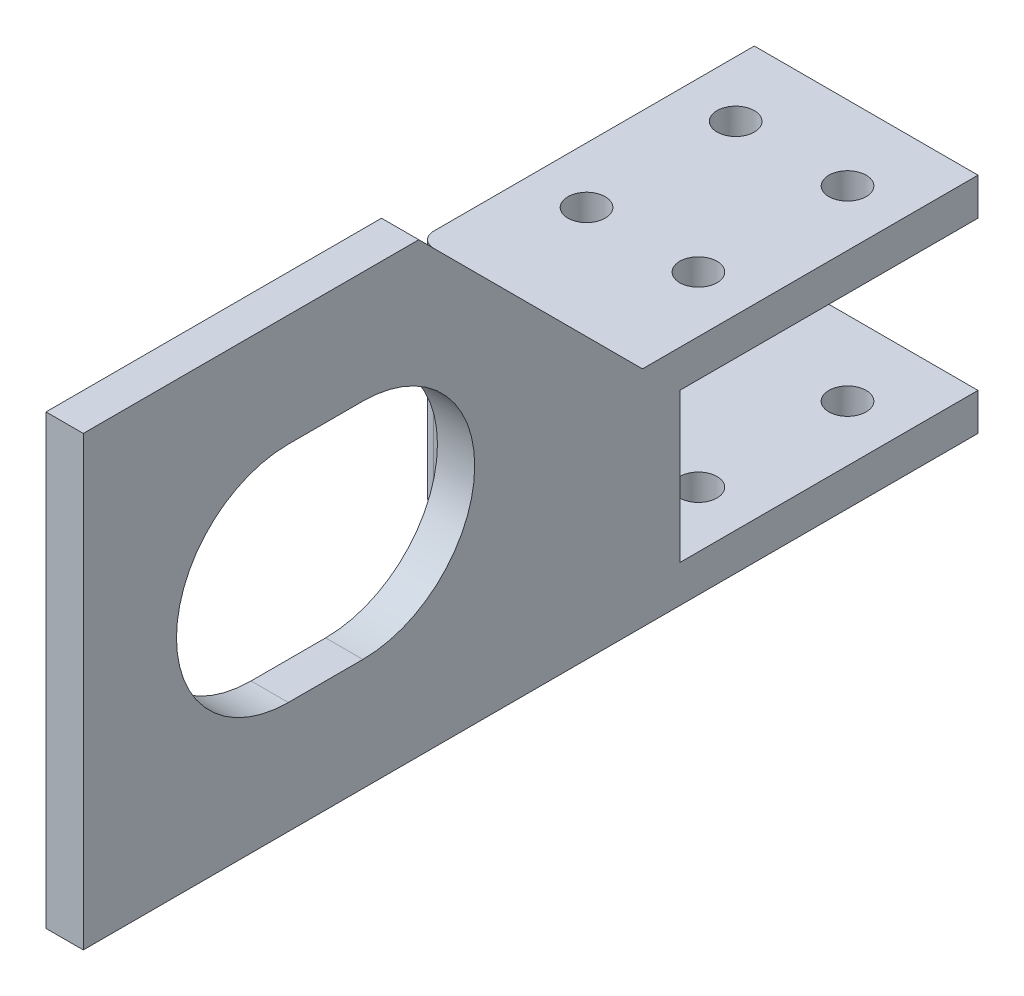
ISO-10303-21;
HEADER;
FILE_DESCRIPTION(('STEP AP214'),'2;1');
FILE_NAME('part.step','',(''),(''),'','','');
FILE_SCHEMA(('AUTOMOTIVE_DESIGN { 1 0 10303 214 1 1 1 1 }'));
ENDSEC;
DATA;
#1=APPLICATION_CONTEXT('core data for automotive mechanical design processes');
#2=APPLICATION_PROTOCOL_DEFINITION('international standard','automotive_design',2000,#1);
#3=PRODUCT_CONTEXT('',#1,'mechanical');
#4=PRODUCT('Part','Part','',(#3));
#5=PRODUCT_RELATED_PRODUCT_CATEGORY('part','',(#4));
#6=PRODUCT_DEFINITION_FORMATION('','',#4);
#7=PRODUCT_DEFINITION_CONTEXT('part definition',#1,'design');
#8=PRODUCT_DEFINITION('design','',#6,#7);
#9=PRODUCT_DEFINITION_SHAPE('','',#8);
#10=(LENGTH_UNIT() NAMED_UNIT(*) SI_UNIT(.MILLI.,.METRE.));
#11=(NAMED_UNIT(*) PLANE_ANGLE_UNIT() SI_UNIT($,.RADIAN.));
#12=(NAMED_UNIT(*) SI_UNIT($,.STERADIAN.) SOLID_ANGLE_UNIT());
#13=UNCERTAINTY_MEASURE_WITH_UNIT(LENGTH_MEASURE(1.E-05),#10,'distance_accuracy_value','');
#14=(GEOMETRIC_REPRESENTATION_CONTEXT(3) GLOBAL_UNCERTAINTY_ASSIGNED_CONTEXT((#13)) GLOBAL_UNIT_ASSIGNED_CONTEXT((#10,
#11,#12)) REPRESENTATION_CONTEXT('',''));
#15=CARTESIAN_POINT('',(0.,0.,0.));
#16=DIRECTION('',(0.,0.,1.));
#17=DIRECTION('',(1.,0.,0.));
#18=AXIS2_PLACEMENT_3D('',#15,#16,#17);
#19=CARTESIAN_POINT('',(15.,-15.,25.));
#20=DIRECTION('',(0.,0.,-1.));
#21=DIRECTION('',(-1.,0.,0.));
#22=AXIS2_PLACEMENT_3D('',#19,#20,#21);
#23=PLANE('',#22);
#24=DIRECTION('',(-1.,0.,0.));
#25=VECTOR('',#24,1.);
#26=CARTESIAN_POINT('',(15.,15.,25.));
#27=LINE('',#26,#25);
#28=CARTESIAN_POINT('',(5.,15.,25.));
#29=VERTEX_POINT('',#28);
#30=CARTESIAN_POINT('',(-13.,15.,25.));
#31=VERTEX_POINT('',#30);
#32=EDGE_CURVE('E310',#29,#31,#27,.T.);
#33=ORIENTED_EDGE('',*,*,#32,.T.);
#34=DIRECTION('',(0.,1.,0.));
#35=VECTOR('',#34,1.);
#36=CARTESIAN_POINT('',(-13.,-15.,25.));
#37=LINE('',#36,#35);
#38=CARTESIAN_POINT('',(-13.,-15.,25.));
#39=VERTEX_POINT('',#38);
#40=EDGE_CURVE('E57',#31,#39,#37,.F.);
#41=ORIENTED_EDGE('',*,*,#40,.T.);
#42=DIRECTION('',(-1.,0.,0.));
#43=VECTOR('',#42,1.);
#44=CARTESIAN_POINT('',(15.,-15.,25.));
#45=LINE('',#44,#43);
#46=CARTESIAN_POINT('',(5.,-15.,25.));
#47=VERTEX_POINT('',#46);
#48=EDGE_CURVE('E307',#47,#39,#45,.T.);
#49=ORIENTED_EDGE('',*,*,#48,.F.);
#50=DIRECTION('',(0.,1.,0.));
#51=VECTOR('',#50,1.);
#52=CARTESIAN_POINT('',(5.,-15.,25.));
#53=LINE('',#52,#51);
#54=EDGE_CURVE('E339',#47,#29,#53,.T.);
#55=ORIENTED_EDGE('',*,*,#54,.T.);
#56=EDGE_LOOP('',(#33,#41,#49,#55));
#57=FACE_BOUND('',#56,.T.);
#58=ADVANCED_FACE('F47',(#57),#23,.F.);
#59=CARTESIAN_POINT('',(15.,15.,-20.));
#60=DIRECTION('',(0.,0.,1.));
#61=DIRECTION('',(0.,-1.,0.));
#62=AXIS2_PLACEMENT_3D('',#59,#60,#61);
#63=PLANE('',#62);
#64=DIRECTION('',(0.,1.,0.));
#65=VECTOR('',#64,1.);
#66=CARTESIAN_POINT('',(-15.,15.,-20.));
#67=LINE('',#66,#65);
#68=CARTESIAN_POINT('',(-15.,10.,-20.));
#69=VERTEX_POINT('',#68);
#70=CARTESIAN_POINT('',(-15.,15.,-20.));
#71=VERTEX_POINT('',#70);
#72=EDGE_CURVE('E242',#69,#71,#67,.T.);
#73=ORIENTED_EDGE('',*,*,#72,.T.);
#74=DIRECTION('',(-1.,0.,0.));
#75=VECTOR('',#74,1.);
#76=CARTESIAN_POINT('',(15.,15.,-20.));
#77=LINE('',#76,#75);
#78=CARTESIAN_POINT('',(15.,15.,-20.));
#79=VERTEX_POINT('',#78);
#80=EDGE_CURVE('E314',#79,#71,#77,.T.);
#81=ORIENTED_EDGE('',*,*,#80,.F.);
#82=DIRECTION('',(0.,1.,0.));
#83=VECTOR('',#82,1.);
#84=CARTESIAN_POINT('',(15.,15.,-20.));
#85=LINE('',#84,#83);
#86=CARTESIAN_POINT('',(15.,10.,-20.));
#87=VERTEX_POINT('',#86);
#88=EDGE_CURVE('E243',#87,#79,#85,.T.);
#89=ORIENTED_EDGE('',*,*,#88,.F.);
#90=DIRECTION('',(-1.,0.,0.));
#91=VECTOR('',#90,1.);
#92=CARTESIAN_POINT('',(15.,10.,-20.));
#93=LINE('',#92,#91);
#94=EDGE_CURVE('E267',#87,#69,#93,.T.);
#95=ORIENTED_EDGE('',*,*,#94,.T.);
#96=EDGE_LOOP('',(#73,#81,#89,#95));
#97=FACE_BOUND('',#96,.T.);
#98=ADVANCED_FACE('F438',(#97),#63,.F.);
#99=CARTESIAN_POINT('',(15.,15.,25.));
#100=DIRECTION('',(0.,-1.,0.));
#101=DIRECTION('',(0.,0.,-1.));
#102=AXIS2_PLACEMENT_3D('',#99,#100,#101);
#103=PLANE('',#102);
#104=CARTESIAN_POINT('',(7.5,15.,10.));
#105=DIRECTION('',(0.,-1.,0.));
#106=DIRECTION('',(0.,0.,-1.));
#107=AXIS2_PLACEMENT_3D('',#104,#105,#106);
#108=CIRCLE('',#107,2.5);
#109=CARTESIAN_POINT('',(7.5,15.,7.5));
#110=VERTEX_POINT('',#109);
#111=EDGE_CURVE('E399',#110,#110,#108,.T.);
#112=ORIENTED_EDGE('',*,*,#111,.T.);
#113=EDGE_LOOP('',(#112));
#114=FACE_BOUND('',#113,.T.);
#115=CARTESIAN_POINT('',(-7.5,15.,-10.));
#116=DIRECTION('',(0.,-1.,0.));
#117=DIRECTION('',(0.,0.,-1.));
#118=AXIS2_PLACEMENT_3D('',#115,#116,#117);
#119=CIRCLE('',#118,2.5);
#120=CARTESIAN_POINT('',(-7.5,15.,-12.5));
#121=VERTEX_POINT('',#120);
#122=EDGE_CURVE('E381',#121,#121,#119,.T.);
#123=ORIENTED_EDGE('',*,*,#122,.T.);
#124=EDGE_LOOP('',(#123));
#125=FACE_BOUND('',#124,.T.);
#126=CARTESIAN_POINT('',(7.5,15.,-10.));
#127=DIRECTION('',(0.,-1.,0.));
#128=DIRECTION('',(0.,0.,-1.));
#129=AXIS2_PLACEMENT_3D('',#126,#127,#128);
#130=CIRCLE('',#129,2.5);
#131=CARTESIAN_POINT('',(7.5,15.,-12.5));
#132=VERTEX_POINT('',#131);
#133=EDGE_CURVE('E375',#132,#132,#130,.T.);
#134=ORIENTED_EDGE('',*,*,#133,.T.);
#135=EDGE_LOOP('',(#134));
#136=FACE_BOUND('',#135,.T.);
#137=CARTESIAN_POINT('',(-7.5,15.,10.));
#138=DIRECTION('',(0.,-1.,0.));
#139=DIRECTION('',(0.,0.,-1.));
#140=AXIS2_PLACEMENT_3D('',#137,#138,#139);
#141=CIRCLE('',#140,2.5);
#142=CARTESIAN_POINT('',(-7.5,15.,7.5));
#143=VERTEX_POINT('',#142);
#144=EDGE_CURVE('E370',#143,#143,#141,.T.);
#145=ORIENTED_EDGE('',*,*,#144,.T.);
#146=EDGE_LOOP('',(#145));
#147=FACE_BOUND('',#146,.T.);
#148=DIRECTION('',(0.,0.,1.));
#149=VECTOR('',#148,1.);
#150=CARTESIAN_POINT('',(-15.,15.,25.));
#151=LINE('',#150,#149);
#152=CARTESIAN_POINT('',(-15.,15.,23.));
#153=VERTEX_POINT('',#152);
#154=EDGE_CURVE('E271',#71,#153,#151,.T.);
#155=ORIENTED_EDGE('',*,*,#154,.T.);
#156=CARTESIAN_POINT('',(-13.,15.,23.));
#157=DIRECTION('',(0.,-1.,0.));
#158=DIRECTION('',(0.,0.,-1.));
#159=AXIS2_PLACEMENT_3D('',#156,#157,#158);
#160=CIRCLE('',#159,2.);
#161=EDGE_CURVE('E72',#153,#31,#160,.F.);
#162=ORIENTED_EDGE('',*,*,#161,.T.);
#163=ORIENTED_EDGE('',*,*,#32,.F.);
#164=CARTESIAN_POINT('',(15.,15.,25.));
#165=VERTEX_POINT('',#164);
#166=EDGE_CURVE('E311',#165,#29,#27,.T.);
#167=ORIENTED_EDGE('',*,*,#166,.F.);
#168=DIRECTION('',(0.,0.,1.));
#169=VECTOR('',#168,1.);
#170=CARTESIAN_POINT('',(15.,15.,25.));
#171=LINE('',#170,#169);
#172=EDGE_CURVE('E247',#79,#165,#171,.T.);
#173=ORIENTED_EDGE('',*,*,#172,.F.);
#174=ORIENTED_EDGE('',*,*,#80,.T.);
#175=EDGE_LOOP('',(#155,#162,#163,#167,#173,#174));
#176=FACE_BOUND('',#175,.T.);
#177=ADVANCED_FACE('F430',(#114,#125,#136,#147,#176),#103,.F.);
#178=CARTESIAN_POINT('',(15.,-15.,-20.));
#179=DIRECTION('',(0.,1.,0.));
#180=DIRECTION('',(0.,0.,1.));
#181=AXIS2_PLACEMENT_3D('',#178,#179,#180);
#182=PLANE('',#181);
#183=CARTESIAN_POINT('',(7.5,-15.,10.));
#184=DIRECTION('',(0.,1.,0.));
#185=DIRECTION('',(0.,0.,1.));
#186=AXIS2_PLACEMENT_3D('',#183,#184,#185);
#187=CIRCLE('',#186,2.5);
#188=CARTESIAN_POINT('',(7.5,-15.,12.5));
#189=VERTEX_POINT('',#188);
#190=EDGE_CURVE('E561',#189,#189,#187,.T.);
#191=ORIENTED_EDGE('',*,*,#190,.T.);
#192=EDGE_LOOP('',(#191));
#193=FACE_BOUND('',#192,.T.);
#194=CARTESIAN_POINT('',(-7.5,-15.,-10.));
#195=DIRECTION('',(0.,1.,0.));
#196=DIRECTION('',(0.,0.,1.));
#197=AXIS2_PLACEMENT_3D('',#194,#195,#196);
#198=CIRCLE('',#197,2.5);
#199=CARTESIAN_POINT('',(-7.5,-15.,-7.5));
#200=VERTEX_POINT('',#199);
#201=EDGE_CURVE('E562',#200,#200,#198,.T.);
#202=ORIENTED_EDGE('',*,*,#201,.T.);
#203=EDGE_LOOP('',(#202));
#204=FACE_BOUND('',#203,.T.);
#205=CARTESIAN_POINT('',(7.5,-15.,-10.));
#206=DIRECTION('',(0.,1.,0.));
#207=DIRECTION('',(0.,0.,1.));
#208=AXIS2_PLACEMENT_3D('',#205,#206,#207);
#209=CIRCLE('',#208,2.5);
#210=CARTESIAN_POINT('',(7.5,-15.,-7.5));
#211=VERTEX_POINT('',#210);
#212=EDGE_CURVE('E543',#211,#211,#209,.T.);
#213=ORIENTED_EDGE('',*,*,#212,.T.);
#214=EDGE_LOOP('',(#213));
#215=FACE_BOUND('',#214,.T.);
#216=CARTESIAN_POINT('',(-7.5,-15.,10.));
#217=DIRECTION('',(0.,1.,0.));
#218=DIRECTION('',(0.,0.,1.));
#219=AXIS2_PLACEMENT_3D('',#216,#217,#218);
#220=CIRCLE('',#219,2.5);
#221=CARTESIAN_POINT('',(-7.5,-15.,12.5));
#222=VERTEX_POINT('',#221);
#223=EDGE_CURVE('E365',#222,#222,#220,.T.);
#224=ORIENTED_EDGE('',*,*,#223,.T.);
#225=EDGE_LOOP('',(#224));
#226=FACE_BOUND('',#225,.T.);
#227=ORIENTED_EDGE('',*,*,#48,.T.);
#228=CARTESIAN_POINT('',(-13.,-15.,23.));
#229=DIRECTION('',(0.,1.,0.));
#230=DIRECTION('',(0.,0.,1.));
#231=AXIS2_PLACEMENT_3D('',#228,#229,#230);
#232=CIRCLE('',#231,2.);
#233=CARTESIAN_POINT('',(-15.,-15.,23.));
#234=VERTEX_POINT('',#233);
#235=EDGE_CURVE('E11',#39,#234,#232,.F.);
#236=ORIENTED_EDGE('',*,*,#235,.T.);
#237=DIRECTION('',(0.,0.,-1.));
#238=VECTOR('',#237,1.);
#239=CARTESIAN_POINT('',(-15.,-15.,-20.));
#240=LINE('',#239,#238);
#241=CARTESIAN_POINT('',(-15.,-15.,-20.));
#242=VERTEX_POINT('',#241);
#243=EDGE_CURVE('E274',#234,#242,#240,.T.);
#244=ORIENTED_EDGE('',*,*,#243,.T.);
#245=DIRECTION('',(-1.,0.,0.));
#246=VECTOR('',#245,1.);
#247=CARTESIAN_POINT('',(15.,-15.,-20.));
#248=LINE('',#247,#246);
#249=CARTESIAN_POINT('',(15.,-15.,-20.));
#250=VERTEX_POINT('',#249);
#251=EDGE_CURVE('E303',#250,#242,#248,.T.);
#252=ORIENTED_EDGE('',*,*,#251,.F.);
#253=DIRECTION('',(0.,0.,-1.));
#254=VECTOR('',#253,1.);
#255=CARTESIAN_POINT('',(15.,-15.,-20.));
#256=LINE('',#255,#254);
#257=CARTESIAN_POINT('',(15.,-15.,100.));
#258=VERTEX_POINT('',#257);
#259=EDGE_CURVE('E252',#258,#250,#256,.T.);
#260=ORIENTED_EDGE('',*,*,#259,.F.);
#261=DIRECTION('',(-1.,0.,0.));
#262=VECTOR('',#261,1.);
#263=CARTESIAN_POINT('',(10.,-15.,100.));
#264=LINE('',#263,#262);
#265=CARTESIAN_POINT('',(10.,-15.,100.));
#266=VERTEX_POINT('',#265);
#267=EDGE_CURVE('E218',#258,#266,#264,.T.);
#268=ORIENTED_EDGE('',*,*,#267,.T.);
#269=DIRECTION('',(0.,0.,-1.));
#270=VECTOR('',#269,1.);
#271=CARTESIAN_POINT('',(10.,-15.,100.));
#272=LINE('',#271,#270);
#273=CARTESIAN_POINT('',(10.,-15.,30.));
#274=VERTEX_POINT('',#273);
#275=EDGE_CURVE('E238',#266,#274,#272,.T.);
#276=ORIENTED_EDGE('',*,*,#275,.T.);
#277=CARTESIAN_POINT('',(5.,-15.,30.));
#278=DIRECTION('',(0.,1.,0.));
#279=DIRECTION('',(0.,0.,1.));
#280=AXIS2_PLACEMENT_3D('',#277,#278,#279);
#281=CIRCLE('',#280,5.);
#282=EDGE_CURVE('E349',#274,#47,#281,.T.);
#283=ORIENTED_EDGE('',*,*,#282,.T.);
#284=EDGE_LOOP('',(#227,#236,#244,#252,#260,#268,#276,#283));
#285=FACE_BOUND('',#284,.T.);
#286=ADVANCED_FACE('F427',(#193,#204,#215,#226,#285),#182,.F.);
#287=CARTESIAN_POINT('',(15.,-10.,-20.));
#288=DIRECTION('',(0.,0.,1.));
#289=DIRECTION('',(0.,-1.,0.));
#290=AXIS2_PLACEMENT_3D('',#287,#288,#289);
#291=PLANE('',#290);
#292=DIRECTION('',(0.,1.,0.));
#293=VECTOR('',#292,1.);
#294=CARTESIAN_POINT('',(-15.,-10.,-20.));
#295=LINE('',#294,#293);
#296=CARTESIAN_POINT('',(-15.,-10.,-20.));
#297=VERTEX_POINT('',#296);
#298=EDGE_CURVE('E277',#242,#297,#295,.T.);
#299=ORIENTED_EDGE('',*,*,#298,.T.);
#300=DIRECTION('',(-1.,0.,0.));
#301=VECTOR('',#300,1.);
#302=CARTESIAN_POINT('',(15.,-10.,-20.));
#303=LINE('',#302,#301);
#304=CARTESIAN_POINT('',(15.,-10.,-20.));
#305=VERTEX_POINT('',#304);
#306=EDGE_CURVE('E299',#305,#297,#303,.T.);
#307=ORIENTED_EDGE('',*,*,#306,.F.);
#308=DIRECTION('',(0.,1.,0.));
#309=VECTOR('',#308,1.);
#310=CARTESIAN_POINT('',(15.,-10.,-20.));
#311=LINE('',#310,#309);
#312=EDGE_CURVE('E255',#250,#305,#311,.T.);
#313=ORIENTED_EDGE('',*,*,#312,.F.);
#314=ORIENTED_EDGE('',*,*,#251,.T.);
#315=EDGE_LOOP('',(#299,#307,#313,#314));
#316=FACE_BOUND('',#315,.T.);
#317=ADVANCED_FACE('F449',(#316),#291,.F.);
#318=CARTESIAN_POINT('',(15.,-10.,20.));
#319=DIRECTION('',(0.,-1.,0.));
#320=DIRECTION('',(0.,0.,-1.));
#321=AXIS2_PLACEMENT_3D('',#318,#319,#320);
#322=PLANE('',#321);
#323=CARTESIAN_POINT('',(7.5,-10.,10.));
#324=DIRECTION('',(0.,-1.,0.));
#325=DIRECTION('',(0.,0.,-1.));
#326=AXIS2_PLACEMENT_3D('',#323,#324,#325);
#327=CIRCLE('',#326,2.5);
#328=CARTESIAN_POINT('',(7.5,-10.,7.5));
#329=VERTEX_POINT('',#328);
#330=EDGE_CURVE('E395',#329,#329,#327,.T.);
#331=ORIENTED_EDGE('',*,*,#330,.T.);
#332=EDGE_LOOP('',(#331));
#333=FACE_BOUND('',#332,.T.);
#334=CARTESIAN_POINT('',(-7.5,-10.,-10.));
#335=DIRECTION('',(0.,-1.,0.));
#336=DIRECTION('',(0.,0.,-1.));
#337=AXIS2_PLACEMENT_3D('',#334,#335,#336);
#338=CIRCLE('',#337,2.5);
#339=CARTESIAN_POINT('',(-7.5,-10.,-12.5));
#340=VERTEX_POINT('',#339);
#341=EDGE_CURVE('E374',#340,#340,#338,.T.);
#342=ORIENTED_EDGE('',*,*,#341,.T.);
#343=EDGE_LOOP('',(#342));
#344=FACE_BOUND('',#343,.T.);
#345=CARTESIAN_POINT('',(7.5,-10.,-10.));
#346=DIRECTION('',(0.,-1.,0.));
#347=DIRECTION('',(0.,0.,-1.));
#348=AXIS2_PLACEMENT_3D('',#345,#346,#347);
#349=CIRCLE('',#348,2.5);
#350=CARTESIAN_POINT('',(7.5,-10.,-12.5));
#351=VERTEX_POINT('',#350);
#352=EDGE_CURVE('E369',#351,#351,#349,.T.);
#353=ORIENTED_EDGE('',*,*,#352,.T.);
#354=EDGE_LOOP('',(#353));
#355=FACE_BOUND('',#354,.T.);
#356=CARTESIAN_POINT('',(-7.5,-10.,10.));
#357=DIRECTION('',(0.,-1.,0.));
#358=DIRECTION('',(0.,0.,-1.));
#359=AXIS2_PLACEMENT_3D('',#356,#357,#358);
#360=CIRCLE('',#359,2.5);
#361=CARTESIAN_POINT('',(-7.5,-10.,7.5));
#362=VERTEX_POINT('',#361);
#363=EDGE_CURVE('E364',#362,#362,#360,.T.);
#364=ORIENTED_EDGE('',*,*,#363,.T.);
#365=EDGE_LOOP('',(#364));
#366=FACE_BOUND('',#365,.T.);
#367=DIRECTION('',(0.,0.,1.));
#368=VECTOR('',#367,1.);
#369=CARTESIAN_POINT('',(-15.,-10.,20.));
#370=LINE('',#369,#368);
#371=CARTESIAN_POINT('',(-15.,-10.,20.));
#372=VERTEX_POINT('',#371);
#373=EDGE_CURVE('E280',#297,#372,#370,.T.);
#374=ORIENTED_EDGE('',*,*,#373,.T.);
#375=DIRECTION('',(-1.,0.,0.));
#376=VECTOR('',#375,1.);
#377=CARTESIAN_POINT('',(15.,-10.,20.));
#378=LINE('',#377,#376);
#379=CARTESIAN_POINT('',(15.,-10.,20.));
#380=VERTEX_POINT('',#379);
#381=EDGE_CURVE('E295',#380,#372,#378,.T.);
#382=ORIENTED_EDGE('',*,*,#381,.F.);
#383=DIRECTION('',(0.,0.,1.));
#384=VECTOR('',#383,1.);
#385=CARTESIAN_POINT('',(15.,-10.,20.));
#386=LINE('',#385,#384);
#387=EDGE_CURVE('E258',#305,#380,#386,.T.);
#388=ORIENTED_EDGE('',*,*,#387,.F.);
#389=ORIENTED_EDGE('',*,*,#306,.T.);
#390=EDGE_LOOP('',(#374,#382,#388,#389));
#391=FACE_BOUND('',#390,.T.);
#392=ADVANCED_FACE('F455',(#333,#344,#355,#366,#391),#322,.F.);
#393=CARTESIAN_POINT('',(15.,10.,20.));
#394=DIRECTION('',(0.,0.,1.));
#395=DIRECTION('',(1.,0.,0.));
#396=AXIS2_PLACEMENT_3D('',#393,#394,#395);
#397=PLANE('',#396);
#398=DIRECTION('',(0.,1.,0.));
#399=VECTOR('',#398,1.);
#400=CARTESIAN_POINT('',(-15.,10.,20.));
#401=LINE('',#400,#399);
#402=CARTESIAN_POINT('',(-15.,10.,20.));
#403=VERTEX_POINT('',#402);
#404=EDGE_CURVE('E283',#372,#403,#401,.T.);
#405=ORIENTED_EDGE('',*,*,#404,.T.);
#406=DIRECTION('',(-1.,0.,0.));
#407=VECTOR('',#406,1.);
#408=CARTESIAN_POINT('',(15.,10.,20.));
#409=LINE('',#408,#407);
#410=CARTESIAN_POINT('',(15.,10.,20.));
#411=VERTEX_POINT('',#410);
#412=EDGE_CURVE('E291',#411,#403,#409,.T.);
#413=ORIENTED_EDGE('',*,*,#412,.F.);
#414=DIRECTION('',(0.,1.,0.));
#415=VECTOR('',#414,1.);
#416=CARTESIAN_POINT('',(15.,10.,20.));
#417=LINE('',#416,#415);
#418=EDGE_CURVE('E261',#380,#411,#417,.T.);
#419=ORIENTED_EDGE('',*,*,#418,.F.);
#420=ORIENTED_EDGE('',*,*,#381,.T.);
#421=EDGE_LOOP('',(#405,#413,#419,#420));
#422=FACE_BOUND('',#421,.T.);
#423=ADVANCED_FACE('F459',(#422),#397,.F.);
#424=CARTESIAN_POINT('',(15.,10.,-20.));
#425=DIRECTION('',(0.,1.,0.));
#426=DIRECTION('',(0.,0.,1.));
#427=AXIS2_PLACEMENT_3D('',#424,#425,#426);
#428=PLANE('',#427);
#429=CARTESIAN_POINT('',(7.5,10.,10.));
#430=DIRECTION('',(0.,1.,0.));
#431=DIRECTION('',(0.,0.,1.));
#432=AXIS2_PLACEMENT_3D('',#429,#430,#431);
#433=CIRCLE('',#432,2.5);
#434=CARTESIAN_POINT('',(7.5,10.,12.5));
#435=VERTEX_POINT('',#434);
#436=EDGE_CURVE('E51',#435,#435,#433,.T.);
#437=ORIENTED_EDGE('',*,*,#436,.T.);
#438=EDGE_LOOP('',(#437));
#439=FACE_BOUND('',#438,.T.);
#440=CARTESIAN_POINT('',(-7.5,10.,-10.));
#441=DIRECTION('',(0.,1.,0.));
#442=DIRECTION('',(0.,0.,1.));
#443=AXIS2_PLACEMENT_3D('',#440,#441,#442);
#444=CIRCLE('',#443,2.5);
#445=CARTESIAN_POINT('',(-7.5,10.,-7.5));
#446=VERTEX_POINT('',#445);
#447=EDGE_CURVE('E371',#446,#446,#444,.T.);
#448=ORIENTED_EDGE('',*,*,#447,.T.);
#449=EDGE_LOOP('',(#448));
#450=FACE_BOUND('',#449,.T.);
#451=CARTESIAN_POINT('',(7.5,10.,-10.));
#452=DIRECTION('',(0.,1.,0.));
#453=DIRECTION('',(0.,0.,1.));
#454=AXIS2_PLACEMENT_3D('',#451,#452,#453);
#455=CIRCLE('',#454,2.5);
#456=CARTESIAN_POINT('',(7.5,10.,-7.5));
#457=VERTEX_POINT('',#456);
#458=EDGE_CURVE('E366',#457,#457,#455,.T.);
#459=ORIENTED_EDGE('',*,*,#458,.T.);
#460=EDGE_LOOP('',(#459));
#461=FACE_BOUND('',#460,.T.);
#462=CARTESIAN_POINT('',(-7.5,10.,10.));
#463=DIRECTION('',(0.,1.,0.));
#464=DIRECTION('',(0.,0.,1.));
#465=AXIS2_PLACEMENT_3D('',#462,#463,#464);
#466=CIRCLE('',#465,2.5);
#467=CARTESIAN_POINT('',(-7.5,10.,12.5));
#468=VERTEX_POINT('',#467);
#469=EDGE_CURVE('E360',#468,#468,#466,.T.);
#470=ORIENTED_EDGE('',*,*,#469,.T.);
#471=EDGE_LOOP('',(#470));
#472=FACE_BOUND('',#471,.T.);
#473=DIRECTION('',(0.,0.,-1.));
#474=VECTOR('',#473,1.);
#475=CARTESIAN_POINT('',(-15.,10.,-20.));
#476=LINE('',#475,#474);
#477=EDGE_CURVE('E248',#403,#69,#476,.T.);
#478=ORIENTED_EDGE('',*,*,#477,.T.);
#479=ORIENTED_EDGE('',*,*,#94,.F.);
#480=DIRECTION('',(0.,0.,-1.));
#481=VECTOR('',#480,1.);
#482=CARTESIAN_POINT('',(15.,10.,-20.));
#483=LINE('',#482,#481);
#484=EDGE_CURVE('E264',#411,#87,#483,.T.);
#485=ORIENTED_EDGE('',*,*,#484,.F.);
#486=ORIENTED_EDGE('',*,*,#412,.T.);
#487=EDGE_LOOP('',(#478,#479,#485,#486));
#488=FACE_BOUND('',#487,.T.);
#489=ADVANCED_FACE('F697',(#439,#450,#461,#472,#488),#428,.F.);
#490=CARTESIAN_POINT('',(15.,0.,0.));
#491=DIRECTION('',(-1.,0.,0.));
#492=DIRECTION('',(0.,0.,1.));
#493=AXIS2_PLACEMENT_3D('',#490,#491,#492);
#494=PLANE('',#493);
#495=DIRECTION('',(0.,0.,1.));
#496=VECTOR('',#495,1.);
#497=CARTESIAN_POINT('',(15.,30.,62.5));
#498=LINE('',#497,#496);
#499=CARTESIAN_POINT('',(15.,30.,62.5));
#500=VERTEX_POINT('',#499);
#501=CARTESIAN_POINT('',(15.,30.,72.5));
#502=VERTEX_POINT('',#501);
#503=EDGE_CURVE('E189',#500,#502,#498,.T.);
#504=ORIENTED_EDGE('',*,*,#503,.F.);
#505=CARTESIAN_POINT('',(15.,15.,62.5));
#506=DIRECTION('',(1.,0.,0.));
#507=DIRECTION('',(0.,0.,-1.));
#508=AXIS2_PLACEMENT_3D('',#505,#506,#507);
#509=CIRCLE('',#508,15.);
#510=CARTESIAN_POINT('',(15.,0.,62.5));
#511=VERTEX_POINT('',#510);
#512=EDGE_CURVE('E195',#511,#500,#509,.T.);
#513=ORIENTED_EDGE('',*,*,#512,.F.);
#514=DIRECTION('',(0.,0.,-1.));
#515=VECTOR('',#514,1.);
#516=CARTESIAN_POINT('',(15.,0.,62.5));
#517=LINE('',#516,#515);
#518=CARTESIAN_POINT('',(15.,0.,72.5));
#519=VERTEX_POINT('',#518);
#520=EDGE_CURVE('E200',#519,#511,#517,.T.);
#521=ORIENTED_EDGE('',*,*,#520,.F.);
#522=CARTESIAN_POINT('',(15.,15.,72.5));
#523=DIRECTION('',(1.,0.,0.));
#524=DIRECTION('',(0.,0.,-1.));
#525=AXIS2_PLACEMENT_3D('',#522,#523,#524);
#526=CIRCLE('',#525,15.);
#527=EDGE_CURVE('E177',#502,#519,#526,.T.);
#528=ORIENTED_EDGE('',*,*,#527,.F.);
#529=EDGE_LOOP('',(#504,#513,#521,#528));
#530=FACE_BOUND('',#529,.T.);
#531=ORIENTED_EDGE('',*,*,#172,.T.);
#532=DIRECTION('',(0.,0.707106781186549,0.707106781186546));
#533=VECTOR('',#532,1.);
#534=CARTESIAN_POINT('',(15.,14.9999999999999,25.));
#535=LINE('',#534,#533);
#536=CARTESIAN_POINT('',(15.,45.,55.));
#537=VERTEX_POINT('',#536);
#538=EDGE_CURVE('E318',#165,#537,#535,.T.);
#539=ORIENTED_EDGE('',*,*,#538,.T.);
#540=DIRECTION('',(0.,0.,-1.));
#541=VECTOR('',#540,1.);
#542=CARTESIAN_POINT('',(15.,45.,100.));
#543=LINE('',#542,#541);
#544=CARTESIAN_POINT('',(15.,45.,100.));
#545=VERTEX_POINT('',#544);
#546=EDGE_CURVE('E234',#545,#537,#543,.T.);
#547=ORIENTED_EDGE('',*,*,#546,.F.);
#548=DIRECTION('',(0.,-1.,0.));
#549=VECTOR('',#548,1.);
#550=CARTESIAN_POINT('',(15.,-15.,100.));
#551=LINE('',#550,#549);
#552=EDGE_CURVE('E222',#545,#258,#551,.T.);
#553=ORIENTED_EDGE('',*,*,#552,.T.);
#554=ORIENTED_EDGE('',*,*,#259,.T.);
#555=ORIENTED_EDGE('',*,*,#312,.T.);
#556=ORIENTED_EDGE('',*,*,#387,.T.);
#557=ORIENTED_EDGE('',*,*,#418,.T.);
#558=ORIENTED_EDGE('',*,*,#484,.T.);
#559=ORIENTED_EDGE('',*,*,#88,.T.);
#560=EDGE_LOOP('',(#531,#539,#547,#553,#554,#555,#556,#557,#558,#559));
#561=FACE_BOUND('',#560,.T.);
#562=ADVANCED_FACE('F197',(#530,#561),#494,.F.);
#563=CARTESIAN_POINT('',(-15.,0.,0.));
#564=DIRECTION('',(-1.,0.,0.));
#565=DIRECTION('',(0.,0.,1.));
#566=AXIS2_PLACEMENT_3D('',#563,#564,#565);
#567=PLANE('',#566);
#568=ORIENTED_EDGE('',*,*,#243,.F.);
#569=DIRECTION('',(0.,1.,0.));
#570=VECTOR('',#569,1.);
#571=CARTESIAN_POINT('',(-15.,15.,23.));
#572=LINE('',#571,#570);
#573=EDGE_CURVE('E352',#234,#153,#572,.T.);
#574=ORIENTED_EDGE('',*,*,#573,.T.);
#575=ORIENTED_EDGE('',*,*,#154,.F.);
#576=ORIENTED_EDGE('',*,*,#72,.F.);
#577=ORIENTED_EDGE('',*,*,#477,.F.);
#578=ORIENTED_EDGE('',*,*,#404,.F.);
#579=ORIENTED_EDGE('',*,*,#373,.F.);
#580=ORIENTED_EDGE('',*,*,#298,.F.);
#581=EDGE_LOOP('',(#568,#574,#575,#576,#577,#578,#579,#580));
#582=FACE_BOUND('',#581,.T.);
#583=ADVANCED_FACE('F415',(#582),#567,.T.);
#584=CARTESIAN_POINT('',(10.,-15.,100.));
#585=DIRECTION('',(-1.,0.,0.));
#586=DIRECTION('',(0.,0.,1.));
#587=AXIS2_PLACEMENT_3D('',#584,#585,#586);
#588=PLANE('',#587);
#589=CARTESIAN_POINT('',(10.,15.,62.5));
#590=DIRECTION('',(-1.,0.,0.));
#591=DIRECTION('',(0.,0.,1.));
#592=AXIS2_PLACEMENT_3D('',#589,#590,#591);
#593=CIRCLE('',#592,15.);
#594=CARTESIAN_POINT('',(10.,30.,62.5));
#595=VERTEX_POINT('',#594);
#596=CARTESIAN_POINT('',(10.,0.,62.5));
#597=VERTEX_POINT('',#596);
#598=EDGE_CURVE('E336',#595,#597,#593,.T.);
#599=ORIENTED_EDGE('',*,*,#598,.F.);
#600=DIRECTION('',(0.,0.,-1.));
#601=VECTOR('',#600,1.);
#602=CARTESIAN_POINT('',(10.,30.,100.));
#603=LINE('',#602,#601);
#604=CARTESIAN_POINT('',(10.,30.,72.5));
#605=VERTEX_POINT('',#604);
#606=EDGE_CURVE('E328',#605,#595,#603,.T.);
#607=ORIENTED_EDGE('',*,*,#606,.F.);
#608=CARTESIAN_POINT('',(10.,15.,72.5));
#609=DIRECTION('',(-1.,0.,0.));
#610=DIRECTION('',(0.,0.,1.));
#611=AXIS2_PLACEMENT_3D('',#608,#609,#610);
#612=CIRCLE('',#611,15.);
#613=CARTESIAN_POINT('',(10.,0.,72.5));
#614=VERTEX_POINT('',#613);
#615=EDGE_CURVE('E180',#614,#605,#612,.T.);
#616=ORIENTED_EDGE('',*,*,#615,.F.);
#617=DIRECTION('',(0.,0.,1.));
#618=VECTOR('',#617,1.);
#619=CARTESIAN_POINT('',(10.,0.,100.));
#620=LINE('',#619,#618);
#621=EDGE_CURVE('E333',#597,#614,#620,.T.);
#622=ORIENTED_EDGE('',*,*,#621,.F.);
#623=EDGE_LOOP('',(#599,#607,#616,#622));
#624=FACE_BOUND('',#623,.T.);
#625=DIRECTION('',(0.,-0.707106781186549,-0.707106781186546));
#626=VECTOR('',#625,1.);
#627=CARTESIAN_POINT('',(10.,37.4999999999999,47.4999999999999));
#628=LINE('',#627,#626);
#629=CARTESIAN_POINT('',(10.,45.,55.));
#630=VERTEX_POINT('',#629);
#631=CARTESIAN_POINT('',(10.,19.9999999999999,30.));
#632=VERTEX_POINT('',#631);
#633=EDGE_CURVE('E324',#630,#632,#628,.T.);
#634=ORIENTED_EDGE('',*,*,#633,.T.);
#635=DIRECTION('',(0.,1.,0.));
#636=VECTOR('',#635,1.);
#637=CARTESIAN_POINT('',(10.,-15.,30.));
#638=LINE('',#637,#636);
#639=EDGE_CURVE('E343',#632,#274,#638,.F.);
#640=ORIENTED_EDGE('',*,*,#639,.T.);
#641=ORIENTED_EDGE('',*,*,#275,.F.);
#642=DIRECTION('',(0.,1.,0.));
#643=VECTOR('',#642,1.);
#644=CARTESIAN_POINT('',(10.,-15.,100.));
#645=LINE('',#644,#643);
#646=CARTESIAN_POINT('',(10.,45.,100.));
#647=VERTEX_POINT('',#646);
#648=EDGE_CURVE('E210',#266,#647,#645,.T.);
#649=ORIENTED_EDGE('',*,*,#648,.T.);
#650=DIRECTION('',(0.,0.,-1.));
#651=VECTOR('',#650,1.);
#652=CARTESIAN_POINT('',(10.,45.,100.));
#653=LINE('',#652,#651);
#654=EDGE_CURVE('E230',#647,#630,#653,.T.);
#655=ORIENTED_EDGE('',*,*,#654,.T.);
#656=EDGE_LOOP('',(#634,#640,#641,#649,#655));
#657=FACE_BOUND('',#656,.T.);
#658=ADVANCED_FACE('F411',(#624,#657),#588,.T.);
#659=CARTESIAN_POINT('',(10.,45.,100.));
#660=DIRECTION('',(0.,1.,0.));
#661=DIRECTION('',(0.,0.,1.));
#662=AXIS2_PLACEMENT_3D('',#659,#660,#661);
#663=PLANE('',#662);
#664=ORIENTED_EDGE('',*,*,#546,.T.);
#665=DIRECTION('',(-1.,0.,0.));
#666=VECTOR('',#665,1.);
#667=CARTESIAN_POINT('',(10.,45.,55.));
#668=LINE('',#667,#666);
#669=EDGE_CURVE('E321',#537,#630,#668,.T.);
#670=ORIENTED_EDGE('',*,*,#669,.T.);
#671=ORIENTED_EDGE('',*,*,#654,.F.);
#672=DIRECTION('',(1.,0.,0.));
#673=VECTOR('',#672,1.);
#674=CARTESIAN_POINT('',(10.,45.,100.));
#675=LINE('',#674,#673);
#676=EDGE_CURVE('E226',#647,#545,#675,.T.);
#677=ORIENTED_EDGE('',*,*,#676,.T.);
#678=EDGE_LOOP('',(#664,#670,#671,#677));
#679=FACE_BOUND('',#678,.T.);
#680=ADVANCED_FACE('F414',(#679),#663,.T.);
#681=CARTESIAN_POINT('',(0.,0.,100.));
#682=DIRECTION('',(0.,0.,1.));
#683=DIRECTION('',(-1.,0.,0.));
#684=AXIS2_PLACEMENT_3D('',#681,#682,#683);
#685=PLANE('',#684);
#686=ORIENTED_EDGE('',*,*,#648,.F.);
#687=ORIENTED_EDGE('',*,*,#267,.F.);
#688=ORIENTED_EDGE('',*,*,#552,.F.);
#689=ORIENTED_EDGE('',*,*,#676,.F.);
#690=EDGE_LOOP('',(#686,#687,#688,#689));
#691=FACE_BOUND('',#690,.T.);
#692=ADVANCED_FACE('F465',(#691),#685,.T.);
#693=CARTESIAN_POINT('',(0.,14.9999999999999,25.));
#694=DIRECTION('',(0.,0.707106781186546,-0.707106781186549));
#695=DIRECTION('',(-1.,0.,0.));
#696=AXIS2_PLACEMENT_3D('',#693,#694,#695);
#697=PLANE('',#696);
#698=ORIENTED_EDGE('',*,*,#633,.F.);
#699=ORIENTED_EDGE('',*,*,#669,.F.);
#700=ORIENTED_EDGE('',*,*,#538,.F.);
#701=ORIENTED_EDGE('',*,*,#166,.T.);
#702=CARTESIAN_POINT('',(5.,19.9999999999999,30.));
#703=DIRECTION('',(0.,0.707106781186546,-0.707106781186549));
#704=DIRECTION('',(0.,0.707106781186549,0.707106781186546));
#705=AXIS2_PLACEMENT_3D('',#702,#703,#704);
#706=ELLIPSE('',#705,7.07106781186549,5.);
#707=EDGE_CURVE('E346',#29,#632,#706,.F.);
#708=ORIENTED_EDGE('',*,*,#707,.T.);
#709=EDGE_LOOP('',(#698,#699,#700,#701,#708));
#710=FACE_BOUND('',#709,.T.);
#711=ADVANCED_FACE('F432',(#710),#697,.T.);
#712=CARTESIAN_POINT('',(-15.,15.,62.5));
#713=DIRECTION('',(1.,0.,0.));
#714=DIRECTION('',(0.,0.,-1.));
#715=AXIS2_PLACEMENT_3D('',#712,#713,#714);
#716=CYLINDRICAL_SURFACE('',#715,15.);
#717=ORIENTED_EDGE('',*,*,#598,.T.);
#718=DIRECTION('',(1.,0.,0.));
#719=VECTOR('',#718,1.);
#720=CARTESIAN_POINT('',(-15.,0.,62.5));
#721=LINE('',#720,#719);
#722=EDGE_CURVE('E207',#597,#511,#721,.T.);
#723=ORIENTED_EDGE('',*,*,#722,.T.);
#724=ORIENTED_EDGE('',*,*,#512,.T.);
#725=DIRECTION('',(1.,0.,0.));
#726=VECTOR('',#725,1.);
#727=CARTESIAN_POINT('',(-15.,30.,62.5));
#728=LINE('',#727,#726);
#729=EDGE_CURVE('E185',#595,#500,#728,.T.);
#730=ORIENTED_EDGE('',*,*,#729,.F.);
#731=EDGE_LOOP('',(#717,#723,#724,#730));
#732=FACE_BOUND('',#731,.T.);
#733=ADVANCED_FACE('F404',(#732),#716,.F.);
#734=CARTESIAN_POINT('',(-15.,0.,62.5));
#735=DIRECTION('',(0.,-1.,0.));
#736=DIRECTION('',(0.,0.,-1.));
#737=AXIS2_PLACEMENT_3D('',#734,#735,#736);
#738=PLANE('',#737);
#739=ORIENTED_EDGE('',*,*,#621,.T.);
#740=DIRECTION('',(1.,0.,0.));
#741=VECTOR('',#740,1.);
#742=CARTESIAN_POINT('',(-15.,0.,72.5));
#743=LINE('',#742,#741);
#744=EDGE_CURVE('E184',#614,#519,#743,.T.);
#745=ORIENTED_EDGE('',*,*,#744,.T.);
#746=ORIENTED_EDGE('',*,*,#520,.T.);
#747=ORIENTED_EDGE('',*,*,#722,.F.);
#748=EDGE_LOOP('',(#739,#745,#746,#747));
#749=FACE_BOUND('',#748,.T.);
#750=ADVANCED_FACE('F409',(#749),#738,.F.);
#751=CARTESIAN_POINT('',(-15.,15.,72.5));
#752=DIRECTION('',(1.,0.,0.));
#753=DIRECTION('',(0.,0.,-1.));
#754=AXIS2_PLACEMENT_3D('',#751,#752,#753);
#755=CYLINDRICAL_SURFACE('',#754,15.);
#756=ORIENTED_EDGE('',*,*,#615,.T.);
#757=DIRECTION('',(1.,0.,0.));
#758=VECTOR('',#757,1.);
#759=CARTESIAN_POINT('',(-15.,30.,72.5));
#760=LINE('',#759,#758);
#761=EDGE_CURVE('E172',#605,#502,#760,.T.);
#762=ORIENTED_EDGE('',*,*,#761,.T.);
#763=ORIENTED_EDGE('',*,*,#527,.T.);
#764=ORIENTED_EDGE('',*,*,#744,.F.);
#765=EDGE_LOOP('',(#756,#762,#763,#764));
#766=FACE_BOUND('',#765,.T.);
#767=ADVANCED_FACE('F174',(#766),#755,.F.);
#768=CARTESIAN_POINT('',(-15.,30.,62.5));
#769=DIRECTION('',(0.,1.,0.));
#770=DIRECTION('',(0.,0.,1.));
#771=AXIS2_PLACEMENT_3D('',#768,#769,#770);
#772=PLANE('',#771);
#773=ORIENTED_EDGE('',*,*,#606,.T.);
#774=ORIENTED_EDGE('',*,*,#729,.T.);
#775=ORIENTED_EDGE('',*,*,#503,.T.);
#776=ORIENTED_EDGE('',*,*,#761,.F.);
#777=EDGE_LOOP('',(#773,#774,#775,#776));
#778=FACE_BOUND('',#777,.T.);
#779=ADVANCED_FACE('F190',(#778),#772,.F.);
#780=CARTESIAN_POINT('',(5.,-15.,30.));
#781=DIRECTION('',(0.,1.,0.));
#782=DIRECTION('',(0.,0.,1.));
#783=AXIS2_PLACEMENT_3D('',#780,#781,#782);
#784=CYLINDRICAL_SURFACE('',#783,5.);
#785=ORIENTED_EDGE('',*,*,#282,.F.);
#786=ORIENTED_EDGE('',*,*,#639,.F.);
#787=ORIENTED_EDGE('',*,*,#707,.F.);
#788=ORIENTED_EDGE('',*,*,#54,.F.);
#789=EDGE_LOOP('',(#785,#786,#787,#788));
#790=FACE_BOUND('',#789,.T.);
#791=ADVANCED_FACE('F424',(#790),#784,.F.);
#792=CARTESIAN_POINT('',(-13.,0.,23.));
#793=DIRECTION('',(0.,-1.,0.));
#794=DIRECTION('',(0.,0.,-1.));
#795=AXIS2_PLACEMENT_3D('',#792,#793,#794);
#796=CYLINDRICAL_SURFACE('',#795,2.);
#797=ORIENTED_EDGE('',*,*,#235,.F.);
#798=ORIENTED_EDGE('',*,*,#40,.F.);
#799=ORIENTED_EDGE('',*,*,#161,.F.);
#800=ORIENTED_EDGE('',*,*,#573,.F.);
#801=EDGE_LOOP('',(#797,#798,#799,#800));
#802=FACE_BOUND('',#801,.T.);
#803=ADVANCED_FACE('F49',(#802),#796,.T.);
#804=CARTESIAN_POINT('',(-7.5,-15.,10.));
#805=DIRECTION('',(0.,1.,0.));
#806=DIRECTION('',(0.,0.,1.));
#807=AXIS2_PLACEMENT_3D('',#804,#805,#806);
#808=CYLINDRICAL_SURFACE('',#807,2.5);
#809=ORIENTED_EDGE('',*,*,#469,.F.);
#810=EDGE_LOOP('',(#809));
#811=FACE_BOUND('',#810,.T.);
#812=ORIENTED_EDGE('',*,*,#144,.F.);
#813=EDGE_LOOP('',(#812));
#814=FACE_BOUND('',#813,.T.);
#815=ADVANCED_FACE('F495',(#811,#814),#808,.F.);
#816=CARTESIAN_POINT('',(7.5,-15.,-10.));
#817=DIRECTION('',(0.,1.,0.));
#818=DIRECTION('',(0.,0.,1.));
#819=AXIS2_PLACEMENT_3D('',#816,#817,#818);
#820=CYLINDRICAL_SURFACE('',#819,2.5);
#821=ORIENTED_EDGE('',*,*,#458,.F.);
#822=EDGE_LOOP('',(#821));
#823=FACE_BOUND('',#822,.T.);
#824=ORIENTED_EDGE('',*,*,#133,.F.);
#825=EDGE_LOOP('',(#824));
#826=FACE_BOUND('',#825,.T.);
#827=ADVANCED_FACE('F512',(#823,#826),#820,.F.);
#828=CARTESIAN_POINT('',(-7.5,-15.,-10.));
#829=DIRECTION('',(0.,1.,0.));
#830=DIRECTION('',(0.,0.,1.));
#831=AXIS2_PLACEMENT_3D('',#828,#829,#830);
#832=CYLINDRICAL_SURFACE('',#831,2.5);
#833=ORIENTED_EDGE('',*,*,#447,.F.);
#834=EDGE_LOOP('',(#833));
#835=FACE_BOUND('',#834,.T.);
#836=ORIENTED_EDGE('',*,*,#122,.F.);
#837=EDGE_LOOP('',(#836));
#838=FACE_BOUND('',#837,.T.);
#839=ADVANCED_FACE('F515',(#835,#838),#832,.F.);
#840=CARTESIAN_POINT('',(7.5,-15.,10.));
#841=DIRECTION('',(0.,1.,0.));
#842=DIRECTION('',(0.,0.,1.));
#843=AXIS2_PLACEMENT_3D('',#840,#841,#842);
#844=CYLINDRICAL_SURFACE('',#843,2.5);
#845=ORIENTED_EDGE('',*,*,#436,.F.);
#846=EDGE_LOOP('',(#845));
#847=FACE_BOUND('',#846,.T.);
#848=ORIENTED_EDGE('',*,*,#111,.F.);
#849=EDGE_LOOP('',(#848));
#850=FACE_BOUND('',#849,.T.);
#851=ADVANCED_FACE('F518',(#847,#850),#844,.F.);
#852=ORIENTED_EDGE('',*,*,#223,.F.);
#853=EDGE_LOOP('',(#852));
#854=FACE_BOUND('',#853,.T.);
#855=ORIENTED_EDGE('',*,*,#363,.F.);
#856=EDGE_LOOP('',(#855));
#857=FACE_BOUND('',#856,.T.);
#858=ADVANCED_FACE('F514',(#854,#857),#808,.F.);
#859=ORIENTED_EDGE('',*,*,#212,.F.);
#860=EDGE_LOOP('',(#859));
#861=FACE_BOUND('',#860,.T.);
#862=ORIENTED_EDGE('',*,*,#352,.F.);
#863=EDGE_LOOP('',(#862));
#864=FACE_BOUND('',#863,.T.);
#865=ADVANCED_FACE('F527',(#861,#864),#820,.F.);
#866=ORIENTED_EDGE('',*,*,#201,.F.);
#867=EDGE_LOOP('',(#866));
#868=FACE_BOUND('',#867,.T.);
#869=ORIENTED_EDGE('',*,*,#341,.F.);
#870=EDGE_LOOP('',(#869));
#871=FACE_BOUND('',#870,.T.);
#872=ADVANCED_FACE('F520',(#868,#871),#832,.F.);
#873=ORIENTED_EDGE('',*,*,#190,.F.);
#874=EDGE_LOOP('',(#873));
#875=FACE_BOUND('',#874,.T.);
#876=ORIENTED_EDGE('',*,*,#330,.F.);
#877=EDGE_LOOP('',(#876));
#878=FACE_BOUND('',#877,.T.);
#879=ADVANCED_FACE('F524',(#875,#878),#844,.F.);
#880=CLOSED_SHELL('',(#58,#98,#177,#286,#317,#392,#423,#489,#562,#583,#658,#680,#692,#711,#733,
#750,#767,#779,#791,#803,#815,#827,#839,#851,#858,#865,#872,#879));
#881=MANIFOLD_SOLID_BREP('B2',#880);
#882=ADVANCED_BREP_SHAPE_REPRESENTATION('',(#18,#881),#14);
#883=SHAPE_DEFINITION_REPRESENTATION(#9,#882);
ENDSEC;
END-ISO-10303-21;
